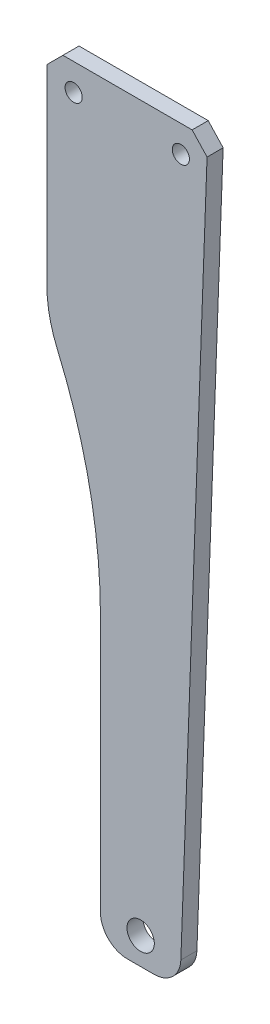
ISO-10303-21;
HEADER;
FILE_DESCRIPTION(('STEP AP214'),'2;1');
FILE_NAME('part.step','',(''),(''),'','','');
FILE_SCHEMA(('AUTOMOTIVE_DESIGN { 1 0 10303 214 1 1 1 1 }'));
ENDSEC;
DATA;
#1=APPLICATION_CONTEXT('core data for automotive mechanical design processes');
#2=APPLICATION_PROTOCOL_DEFINITION('international standard','automotive_design',2000,#1);
#3=PRODUCT_CONTEXT('',#1,'mechanical');
#4=PRODUCT('Part','Part','',(#3));
#5=PRODUCT_RELATED_PRODUCT_CATEGORY('part','',(#4));
#6=PRODUCT_DEFINITION_FORMATION('','',#4);
#7=PRODUCT_DEFINITION_CONTEXT('part definition',#1,'design');
#8=PRODUCT_DEFINITION('design','',#6,#7);
#9=PRODUCT_DEFINITION_SHAPE('','',#8);
#10=(LENGTH_UNIT() NAMED_UNIT(*) SI_UNIT(.MILLI.,.METRE.));
#11=(NAMED_UNIT(*) PLANE_ANGLE_UNIT() SI_UNIT($,.RADIAN.));
#12=(NAMED_UNIT(*) SI_UNIT($,.STERADIAN.) SOLID_ANGLE_UNIT());
#13=UNCERTAINTY_MEASURE_WITH_UNIT(LENGTH_MEASURE(1.E-05),#10,'distance_accuracy_value','');
#14=(GEOMETRIC_REPRESENTATION_CONTEXT(3) GLOBAL_UNCERTAINTY_ASSIGNED_CONTEXT((#13)) GLOBAL_UNIT_ASSIGNED_CONTEXT((#10,
#11,#12)) REPRESENTATION_CONTEXT('',''));
#15=CARTESIAN_POINT('',(0.,0.,0.));
#16=DIRECTION('',(0.,0.,1.));
#17=DIRECTION('',(1.,0.,0.));
#18=AXIS2_PLACEMENT_3D('',#15,#16,#17);
#19=CARTESIAN_POINT('',(0.,0.,3.));
#20=DIRECTION('',(0.,0.,1.));
#21=DIRECTION('',(1.,0.,0.));
#22=AXIS2_PLACEMENT_3D('',#19,#20,#21);
#23=PLANE('',#22);
#24=CARTESIAN_POINT('',(20.,0.,3.));
#25=DIRECTION('',(0.,0.,1.));
#26=DIRECTION('',(1.,0.,0.));
#27=AXIS2_PLACEMENT_3D('',#24,#25,#26);
#28=CIRCLE('',#27,1.6);
#29=CARTESIAN_POINT('',(21.6,0.,3.));
#30=VERTEX_POINT('',#29);
#31=EDGE_CURVE('E224',#30,#30,#28,.T.);
#32=ORIENTED_EDGE('',*,*,#31,.F.);
#33=EDGE_LOOP('',(#32));
#34=FACE_BOUND('',#33,.T.);
#35=CARTESIAN_POINT('',(0.,0.,3.));
#36=DIRECTION('',(0.,0.,1.));
#37=DIRECTION('',(1.,0.,0.));
#38=AXIS2_PLACEMENT_3D('',#35,#36,#37);
#39=CIRCLE('',#38,1.6);
#40=CARTESIAN_POINT('',(1.6,0.,3.));
#41=VERTEX_POINT('',#40);
#42=EDGE_CURVE('E230',#41,#41,#39,.T.);
#43=ORIENTED_EDGE('',*,*,#42,.F.);
#44=EDGE_LOOP('',(#43));
#45=FACE_BOUND('',#44,.T.);
#46=CARTESIAN_POINT('',(12.5,-130.,3.));
#47=DIRECTION('',(0.,0.,1.));
#48=DIRECTION('',(1.,0.,0.));
#49=AXIS2_PLACEMENT_3D('',#46,#47,#48);
#50=CIRCLE('',#49,2.54999999999999);
#51=CARTESIAN_POINT('',(15.05,-130.,3.));
#52=VERTEX_POINT('',#51);
#53=EDGE_CURVE('E207',#52,#52,#50,.T.);
#54=ORIENTED_EDGE('',*,*,#53,.F.);
#55=EDGE_LOOP('',(#54));
#56=FACE_BOUND('',#55,.T.);
#57=DIRECTION('',(-0.0369863533886422,-0.99931577074667,0.));
#58=VECTOR('',#57,1.);
#59=CARTESIAN_POINT('',(24.7809950103569,-0.917186204407043,3.));
#60=LINE('',#59,#58);
#61=CARTESIAN_POINT('',(24.8890409398341,2.00205268775997,3.));
#62=VERTEX_POINT('',#61);
#63=CARTESIAN_POINT('',(19.9965788537334,-130.184931766943,3.));
#64=VERTEX_POINT('',#63);
#65=EDGE_CURVE('E171',#62,#64,#60,.T.);
#66=ORIENTED_EDGE('',*,*,#65,.F.);
#67=DIRECTION('',(0.68046965674916,-0.732776259334103,0.));
#68=VECTOR('',#67,1.);
#69=CARTESIAN_POINT('',(14.3627330182041,13.3375008843198,3.));
#70=LINE('',#69,#68);
#71=CARTESIAN_POINT('',(22.1050913337621,5.,3.));
#72=VERTEX_POINT('',#71);
#73=EDGE_CURVE('E47',#62,#72,#70,.F.);
#74=ORIENTED_EDGE('',*,*,#73,.T.);
#75=DIRECTION('',(-1.,0.,0.));
#76=VECTOR('',#75,1.);
#77=CARTESIAN_POINT('',(-5.,5.,3.));
#78=LINE('',#77,#76);
#79=CARTESIAN_POINT('',(-1.99999999999997,5.,3.));
#80=VERTEX_POINT('',#79);
#81=EDGE_CURVE('E149',#72,#80,#78,.T.);
#82=ORIENTED_EDGE('',*,*,#81,.T.);
#83=DIRECTION('',(0.707106781186547,0.707106781186548,0.));
#84=VECTOR('',#83,1.);
#85=CARTESIAN_POINT('',(-3.49999999999999,3.49999999999999,3.));
#86=LINE('',#85,#84);
#87=CARTESIAN_POINT('',(-5.,1.99999999999997,3.));
#88=VERTEX_POINT('',#87);
#89=EDGE_CURVE('E54',#80,#88,#86,.F.);
#90=ORIENTED_EDGE('',*,*,#89,.T.);
#91=DIRECTION('',(0.,-1.,0.));
#92=VECTOR('',#91,1.);
#93=CARTESIAN_POINT('',(-5.,5.,3.));
#94=LINE('',#93,#92);
#95=CARTESIAN_POINT('',(-5.,-33.5602177653079,3.));
#96=VERTEX_POINT('',#95);
#97=EDGE_CURVE('E152',#88,#96,#94,.T.);
#98=ORIENTED_EDGE('',*,*,#97,.T.);
#99=CARTESIAN_POINT('',(18.8384945881613,-33.5602177653079,3.));
#100=DIRECTION('',(0.,0.,1.));
#101=DIRECTION('',(1.,0.,0.));
#102=AXIS2_PLACEMENT_3D('',#99,#100,#101);
#103=CIRCLE('',#102,23.8384945881613);
#104=CARTESIAN_POINT('',(-3.06746637805268,-42.9624886812358,3.));
#105=VERTEX_POINT('',#104);
#106=EDGE_CURVE('E197',#105,#96,#103,.F.);
#107=ORIENTED_EDGE('',*,*,#106,.F.);
#108=CARTESIAN_POINT('',(-94.5150880736522,-82.2127783683868,3.));
#109=DIRECTION('',(0.,0.,1.));
#110=DIRECTION('',(1.,0.,0.));
#111=AXIS2_PLACEMENT_3D('',#108,#109,#110);
#112=CIRCLE('',#111,99.5150880736522);
#113=CARTESIAN_POINT('',(5.,-82.2127783683868,3.));
#114=VERTEX_POINT('',#113);
#115=EDGE_CURVE('E200',#114,#105,#112,.T.);
#116=ORIENTED_EDGE('',*,*,#115,.F.);
#117=DIRECTION('',(0.,1.,0.));
#118=VECTOR('',#117,1.);
#119=CARTESIAN_POINT('',(5.,0.,3.));
#120=LINE('',#119,#118);
#121=CARTESIAN_POINT('',(5.,-130.,3.));
#122=VERTEX_POINT('',#121);
#123=EDGE_CURVE('E189',#122,#114,#120,.T.);
#124=ORIENTED_EDGE('',*,*,#123,.F.);
#125=CARTESIAN_POINT('',(10.,-130.,3.));
#126=DIRECTION('',(0.,0.,1.));
#127=DIRECTION('',(1.,0.,0.));
#128=AXIS2_PLACEMENT_3D('',#125,#126,#127);
#129=CIRCLE('',#128,5.);
#130=CARTESIAN_POINT('',(10.,-135.,3.));
#131=VERTEX_POINT('',#130);
#132=EDGE_CURVE('E192',#122,#131,#129,.T.);
#133=ORIENTED_EDGE('',*,*,#132,.T.);
#134=DIRECTION('',(1.,0.,0.));
#135=VECTOR('',#134,1.);
#136=CARTESIAN_POINT('',(-4.99999999999998,-135.,3.));
#137=LINE('',#136,#135);
#138=CARTESIAN_POINT('',(15.,-135.,3.));
#139=VERTEX_POINT('',#138);
#140=EDGE_CURVE('E161',#131,#139,#137,.T.);
#141=ORIENTED_EDGE('',*,*,#140,.T.);
#142=CARTESIAN_POINT('',(15.,-130.,3.));
#143=DIRECTION('',(0.,0.,1.));
#144=DIRECTION('',(1.,0.,0.));
#145=AXIS2_PLACEMENT_3D('',#142,#143,#144);
#146=CIRCLE('',#145,5.);
#147=EDGE_CURVE('E130',#139,#64,#146,.T.);
#148=ORIENTED_EDGE('',*,*,#147,.T.);
#149=EDGE_LOOP('',(#66,#74,#82,#90,#98,#107,#116,#124,#133,#141,#148));
#150=FACE_BOUND('',#149,.T.);
#151=ADVANCED_FACE('F39',(#34,#45,#56,#150),#23,.T.);
#152=CARTESIAN_POINT('',(0.,0.,0.));
#153=DIRECTION('',(0.,0.,1.));
#154=DIRECTION('',(1.,0.,0.));
#155=AXIS2_PLACEMENT_3D('',#152,#153,#154);
#156=PLANE('',#155);
#157=CARTESIAN_POINT('',(20.,0.,0.));
#158=DIRECTION('',(0.,0.,1.));
#159=DIRECTION('',(1.,0.,0.));
#160=AXIS2_PLACEMENT_3D('',#157,#158,#159);
#161=CIRCLE('',#160,1.6);
#162=CARTESIAN_POINT('',(21.6,0.,0.));
#163=VERTEX_POINT('',#162);
#164=EDGE_CURVE('E223',#163,#163,#161,.T.);
#165=ORIENTED_EDGE('',*,*,#164,.T.);
#166=EDGE_LOOP('',(#165));
#167=FACE_BOUND('',#166,.T.);
#168=CARTESIAN_POINT('',(0.,0.,0.));
#169=DIRECTION('',(0.,0.,1.));
#170=DIRECTION('',(1.,0.,0.));
#171=AXIS2_PLACEMENT_3D('',#168,#169,#170);
#172=CIRCLE('',#171,1.6);
#173=CARTESIAN_POINT('',(1.6,0.,0.));
#174=VERTEX_POINT('',#173);
#175=EDGE_CURVE('E227',#174,#174,#172,.T.);
#176=ORIENTED_EDGE('',*,*,#175,.T.);
#177=EDGE_LOOP('',(#176));
#178=FACE_BOUND('',#177,.T.);
#179=CARTESIAN_POINT('',(12.5,-130.,0.));
#180=DIRECTION('',(0.,0.,1.));
#181=DIRECTION('',(1.,0.,0.));
#182=AXIS2_PLACEMENT_3D('',#179,#180,#181);
#183=CIRCLE('',#182,2.54999999999999);
#184=CARTESIAN_POINT('',(15.05,-130.,0.));
#185=VERTEX_POINT('',#184);
#186=EDGE_CURVE('E220',#185,#185,#183,.F.);
#187=ORIENTED_EDGE('',*,*,#186,.F.);
#188=EDGE_LOOP('',(#187));
#189=FACE_BOUND('',#188,.T.);
#190=DIRECTION('',(-1.,0.,0.));
#191=VECTOR('',#190,1.);
#192=CARTESIAN_POINT('',(-5.,5.,0.));
#193=LINE('',#192,#191);
#194=CARTESIAN_POINT('',(22.1050913337621,5.,0.));
#195=VERTEX_POINT('',#194);
#196=CARTESIAN_POINT('',(-1.99999999999997,5.,0.));
#197=VERTEX_POINT('',#196);
#198=EDGE_CURVE('E154',#195,#197,#193,.T.);
#199=ORIENTED_EDGE('',*,*,#198,.F.);
#200=DIRECTION('',(-0.68046965674916,0.732776259334103,0.));
#201=VECTOR('',#200,1.);
#202=CARTESIAN_POINT('',(22.1050913337621,5.,0.));
#203=LINE('',#202,#201);
#204=CARTESIAN_POINT('',(24.8890409398341,2.00205268775997,0.));
#205=VERTEX_POINT('',#204);
#206=EDGE_CURVE('E166',#195,#205,#203,.F.);
#207=ORIENTED_EDGE('',*,*,#206,.T.);
#208=DIRECTION('',(-0.0369863533886422,-0.99931577074667,0.));
#209=VECTOR('',#208,1.);
#210=CARTESIAN_POINT('',(24.7809950103569,-0.917186204407043,0.));
#211=LINE('',#210,#209);
#212=CARTESIAN_POINT('',(19.9965788537334,-130.184931766943,0.));
#213=VERTEX_POINT('',#212);
#214=EDGE_CURVE('E143',#205,#213,#211,.T.);
#215=ORIENTED_EDGE('',*,*,#214,.T.);
#216=CARTESIAN_POINT('',(15.,-130.,0.));
#217=DIRECTION('',(0.,0.,1.));
#218=DIRECTION('',(1.,0.,0.));
#219=AXIS2_PLACEMENT_3D('',#216,#217,#218);
#220=CIRCLE('',#219,5.);
#221=CARTESIAN_POINT('',(15.,-135.,0.));
#222=VERTEX_POINT('',#221);
#223=EDGE_CURVE('E128',#222,#213,#220,.T.);
#224=ORIENTED_EDGE('',*,*,#223,.F.);
#225=DIRECTION('',(1.,0.,0.));
#226=VECTOR('',#225,1.);
#227=CARTESIAN_POINT('',(-4.99999999999998,-135.,0.));
#228=LINE('',#227,#226);
#229=CARTESIAN_POINT('',(10.,-135.,0.));
#230=VERTEX_POINT('',#229);
#231=EDGE_CURVE('E141',#230,#222,#228,.T.);
#232=ORIENTED_EDGE('',*,*,#231,.F.);
#233=CARTESIAN_POINT('',(10.,-130.,0.));
#234=DIRECTION('',(0.,0.,1.));
#235=DIRECTION('',(1.,0.,0.));
#236=AXIS2_PLACEMENT_3D('',#233,#234,#235);
#237=CIRCLE('',#236,5.);
#238=CARTESIAN_POINT('',(5.,-130.,0.));
#239=VERTEX_POINT('',#238);
#240=EDGE_CURVE('E145',#239,#230,#237,.T.);
#241=ORIENTED_EDGE('',*,*,#240,.F.);
#242=DIRECTION('',(0.,1.,0.));
#243=VECTOR('',#242,1.);
#244=CARTESIAN_POINT('',(5.,0.,0.));
#245=LINE('',#244,#243);
#246=CARTESIAN_POINT('',(5.,-82.2127783683868,0.));
#247=VERTEX_POINT('',#246);
#248=EDGE_CURVE('E203',#239,#247,#245,.T.);
#249=ORIENTED_EDGE('',*,*,#248,.T.);
#250=CARTESIAN_POINT('',(-94.5150880736522,-82.2127783683868,0.));
#251=DIRECTION('',(0.,0.,1.));
#252=DIRECTION('',(1.,0.,0.));
#253=AXIS2_PLACEMENT_3D('',#250,#251,#252);
#254=CIRCLE('',#253,99.5150880736522);
#255=CARTESIAN_POINT('',(-3.06746637805268,-42.9624886812358,0.));
#256=VERTEX_POINT('',#255);
#257=EDGE_CURVE('E183',#247,#256,#254,.T.);
#258=ORIENTED_EDGE('',*,*,#257,.T.);
#259=CARTESIAN_POINT('',(18.8384945881613,-33.5602177653079,0.));
#260=DIRECTION('',(0.,0.,1.));
#261=DIRECTION('',(1.,0.,0.));
#262=AXIS2_PLACEMENT_3D('',#259,#260,#261);
#263=CIRCLE('',#262,23.8384945881613);
#264=CARTESIAN_POINT('',(-5.,-33.5602177653079,0.));
#265=VERTEX_POINT('',#264);
#266=EDGE_CURVE('E180',#256,#265,#263,.F.);
#267=ORIENTED_EDGE('',*,*,#266,.T.);
#268=DIRECTION('',(0.,-1.,0.));
#269=VECTOR('',#268,1.);
#270=CARTESIAN_POINT('',(-5.,5.,0.));
#271=LINE('',#270,#269);
#272=CARTESIAN_POINT('',(-5.,1.99999999999997,0.));
#273=VERTEX_POINT('',#272);
#274=EDGE_CURVE('E150',#273,#265,#271,.T.);
#275=ORIENTED_EDGE('',*,*,#274,.F.);
#276=DIRECTION('',(-0.707106781186547,-0.707106781186548,0.));
#277=VECTOR('',#276,1.);
#278=CARTESIAN_POINT('',(-5.,1.99999999999997,0.));
#279=LINE('',#278,#277);
#280=EDGE_CURVE('E164',#273,#197,#279,.F.);
#281=ORIENTED_EDGE('',*,*,#280,.T.);
#282=EDGE_LOOP('',(#199,#207,#215,#224,#232,#241,#249,#258,#267,#275,#281));
#283=FACE_BOUND('',#282,.T.);
#284=ADVANCED_FACE('F140',(#167,#178,#189,#283),#156,.F.);
#285=CARTESIAN_POINT('',(-4.99999999999998,-135.,3.));
#286=DIRECTION('',(0.,1.,0.));
#287=DIRECTION('',(0.,0.,1.));
#288=AXIS2_PLACEMENT_3D('',#285,#286,#287);
#289=PLANE('',#288);
#290=ORIENTED_EDGE('',*,*,#231,.T.);
#291=DIRECTION('',(0.,0.,1.));
#292=VECTOR('',#291,1.);
#293=CARTESIAN_POINT('',(15.,-135.,0.));
#294=LINE('',#293,#292);
#295=EDGE_CURVE('E124',#222,#139,#294,.T.);
#296=ORIENTED_EDGE('',*,*,#295,.T.);
#297=ORIENTED_EDGE('',*,*,#140,.F.);
#298=DIRECTION('',(0.,0.,1.));
#299=VECTOR('',#298,1.);
#300=CARTESIAN_POINT('',(10.,-135.,0.));
#301=LINE('',#300,#299);
#302=EDGE_CURVE('E135',#230,#131,#301,.T.);
#303=ORIENTED_EDGE('',*,*,#302,.F.);
#304=EDGE_LOOP('',(#290,#296,#297,#303));
#305=FACE_BOUND('',#304,.T.);
#306=ADVANCED_FACE('F147',(#305),#289,.F.);
#307=CARTESIAN_POINT('',(-5.,5.,3.));
#308=DIRECTION('',(0.,-1.,0.));
#309=DIRECTION('',(0.,0.,-1.));
#310=AXIS2_PLACEMENT_3D('',#307,#308,#309);
#311=PLANE('',#310);
#312=ORIENTED_EDGE('',*,*,#81,.F.);
#313=DIRECTION('',(0.,0.,-1.));
#314=VECTOR('',#313,1.);
#315=CARTESIAN_POINT('',(22.1050913337621,5.,3.));
#316=LINE('',#315,#314);
#317=EDGE_CURVE('E160',#72,#195,#316,.T.);
#318=ORIENTED_EDGE('',*,*,#317,.T.);
#319=ORIENTED_EDGE('',*,*,#198,.T.);
#320=DIRECTION('',(0.,0.,1.));
#321=VECTOR('',#320,1.);
#322=CARTESIAN_POINT('',(-1.99999999999997,5.,3.));
#323=LINE('',#322,#321);
#324=EDGE_CURVE('E158',#197,#80,#323,.T.);
#325=ORIENTED_EDGE('',*,*,#324,.T.);
#326=EDGE_LOOP('',(#312,#318,#319,#325));
#327=FACE_BOUND('',#326,.T.);
#328=ADVANCED_FACE('F175',(#327),#311,.F.);
#329=CARTESIAN_POINT('',(-5.,5.,3.));
#330=DIRECTION('',(1.,0.,0.));
#331=DIRECTION('',(0.,1.,0.));
#332=AXIS2_PLACEMENT_3D('',#329,#330,#331);
#333=PLANE('',#332);
#334=ORIENTED_EDGE('',*,*,#97,.F.);
#335=DIRECTION('',(0.,0.,-1.));
#336=VECTOR('',#335,1.);
#337=CARTESIAN_POINT('',(-5.,1.99999999999997,3.));
#338=LINE('',#337,#336);
#339=EDGE_CURVE('E11',#88,#273,#338,.T.);
#340=ORIENTED_EDGE('',*,*,#339,.T.);
#341=ORIENTED_EDGE('',*,*,#274,.T.);
#342=DIRECTION('',(0.,0.,1.));
#343=VECTOR('',#342,1.);
#344=CARTESIAN_POINT('',(-5.,-33.5602177653079,0.));
#345=LINE('',#344,#343);
#346=EDGE_CURVE('E211',#265,#96,#345,.T.);
#347=ORIENTED_EDGE('',*,*,#346,.T.);
#348=EDGE_LOOP('',(#334,#340,#341,#347));
#349=FACE_BOUND('',#348,.T.);
#350=ADVANCED_FACE('F240',(#349),#333,.F.);
#351=CARTESIAN_POINT('',(0.,0.,3.));
#352=DIRECTION('',(0.,0.,-1.));
#353=DIRECTION('',(-1.,0.,0.));
#354=AXIS2_PLACEMENT_3D('',#351,#352,#353);
#355=CYLINDRICAL_SURFACE('',#354,1.6);
#356=ORIENTED_EDGE('',*,*,#42,.T.);
#357=EDGE_LOOP('',(#356));
#358=FACE_BOUND('',#357,.T.);
#359=ORIENTED_EDGE('',*,*,#175,.F.);
#360=EDGE_LOOP('',(#359));
#361=FACE_BOUND('',#360,.T.);
#362=ADVANCED_FACE('F282',(#358,#361),#355,.F.);
#363=CARTESIAN_POINT('',(20.,0.,3.));
#364=DIRECTION('',(0.,0.,-1.));
#365=DIRECTION('',(-1.,0.,0.));
#366=AXIS2_PLACEMENT_3D('',#363,#364,#365);
#367=CYLINDRICAL_SURFACE('',#366,1.6);
#368=ORIENTED_EDGE('',*,*,#31,.T.);
#369=EDGE_LOOP('',(#368));
#370=FACE_BOUND('',#369,.T.);
#371=ORIENTED_EDGE('',*,*,#164,.F.);
#372=EDGE_LOOP('',(#371));
#373=FACE_BOUND('',#372,.T.);
#374=ADVANCED_FACE('F266',(#370,#373),#367,.F.);
#375=CARTESIAN_POINT('',(12.5,-130.,-0.00100000000000013));
#376=DIRECTION('',(0.,0.,1.));
#377=DIRECTION('',(1.,0.,0.));
#378=AXIS2_PLACEMENT_3D('',#375,#376,#377);
#379=CYLINDRICAL_SURFACE('',#378,2.54999999999999);
#380=CARTESIAN_POINT('',(15.05,-130.,3.));
#381=CARTESIAN_POINT('',(15.05,-130.,2.96875));
#382=CARTESIAN_POINT('',(15.05,-130.,2.9375));
#383=CARTESIAN_POINT('',(15.05,-130.,2.875));
#384=CARTESIAN_POINT('',(15.05,-130.,2.84375));
#385=CARTESIAN_POINT('',(15.05,-130.,2.78125));
#386=CARTESIAN_POINT('',(15.05,-130.,2.75));
#387=CARTESIAN_POINT('',(15.05,-130.,2.6875));
#388=CARTESIAN_POINT('',(15.05,-130.,2.65625));
#389=CARTESIAN_POINT('',(15.05,-130.,2.59375));
#390=CARTESIAN_POINT('',(15.05,-130.,2.5625));
#391=CARTESIAN_POINT('',(15.05,-130.,2.5));
#392=CARTESIAN_POINT('',(15.05,-130.,2.46875));
#393=CARTESIAN_POINT('',(15.05,-130.,2.40625));
#394=CARTESIAN_POINT('',(15.05,-130.,2.375));
#395=CARTESIAN_POINT('',(15.05,-130.,2.3125));
#396=CARTESIAN_POINT('',(15.05,-130.,2.28125));
#397=CARTESIAN_POINT('',(15.05,-130.,2.21875));
#398=CARTESIAN_POINT('',(15.05,-130.,2.1875));
#399=CARTESIAN_POINT('',(15.05,-130.,2.125));
#400=CARTESIAN_POINT('',(15.05,-130.,2.09375));
#401=CARTESIAN_POINT('',(15.05,-130.,2.03125));
#402=CARTESIAN_POINT('',(15.05,-130.,2.));
#403=CARTESIAN_POINT('',(15.05,-130.,1.9375));
#404=CARTESIAN_POINT('',(15.05,-130.,1.90625));
#405=CARTESIAN_POINT('',(15.05,-130.,1.84375));
#406=CARTESIAN_POINT('',(15.05,-130.,1.8125));
#407=CARTESIAN_POINT('',(15.05,-130.,1.75));
#408=CARTESIAN_POINT('',(15.05,-130.,1.71875));
#409=CARTESIAN_POINT('',(15.05,-130.,1.65625));
#410=CARTESIAN_POINT('',(15.05,-130.,1.625));
#411=CARTESIAN_POINT('',(15.05,-130.,1.5625));
#412=CARTESIAN_POINT('',(15.05,-130.,1.53125));
#413=CARTESIAN_POINT('',(15.05,-130.,1.46875));
#414=CARTESIAN_POINT('',(15.05,-130.,1.4375));
#415=CARTESIAN_POINT('',(15.05,-130.,1.375));
#416=CARTESIAN_POINT('',(15.05,-130.,1.34375));
#417=CARTESIAN_POINT('',(15.05,-130.,1.28125));
#418=CARTESIAN_POINT('',(15.05,-130.,1.25));
#419=CARTESIAN_POINT('',(15.05,-130.,1.1875));
#420=CARTESIAN_POINT('',(15.05,-130.,1.15625));
#421=CARTESIAN_POINT('',(15.05,-130.,1.09375));
#422=CARTESIAN_POINT('',(15.05,-130.,1.0625));
#423=CARTESIAN_POINT('',(15.05,-130.,1.));
#424=CARTESIAN_POINT('',(15.05,-130.,0.96875));
#425=CARTESIAN_POINT('',(15.05,-130.,0.90625));
#426=CARTESIAN_POINT('',(15.05,-130.,0.875));
#427=CARTESIAN_POINT('',(15.05,-130.,0.8125));
#428=CARTESIAN_POINT('',(15.05,-130.,0.78125));
#429=CARTESIAN_POINT('',(15.05,-130.,0.71875));
#430=CARTESIAN_POINT('',(15.05,-130.,0.6875));
#431=CARTESIAN_POINT('',(15.05,-130.,0.625));
#432=CARTESIAN_POINT('',(15.05,-130.,0.59375));
#433=CARTESIAN_POINT('',(15.05,-130.,0.53125));
#434=CARTESIAN_POINT('',(15.05,-130.,0.5));
#435=CARTESIAN_POINT('',(15.05,-130.,0.4375));
#436=CARTESIAN_POINT('',(15.05,-130.,0.40625));
#437=CARTESIAN_POINT('',(15.05,-130.,0.34375));
#438=CARTESIAN_POINT('',(15.05,-130.,0.3125));
#439=CARTESIAN_POINT('',(15.05,-130.,0.25));
#440=CARTESIAN_POINT('',(15.05,-130.,0.21875));
#441=CARTESIAN_POINT('',(15.05,-130.,0.15625));
#442=CARTESIAN_POINT('',(15.05,-130.,0.125));
#443=CARTESIAN_POINT('',(15.05,-130.,0.0625000000000001));
#444=CARTESIAN_POINT('',(15.05,-130.,0.0312500000000001));
#445=CARTESIAN_POINT('',(15.05,-130.,0.));
#446=B_SPLINE_CURVE_WITH_KNOTS('',3,(#380,#381,#382,#383,#384,#385,#386,#387,#388,#389,#390,
#391,#392,#393,#394,#395,#396,#397,#398,#399,#400,#401,#402,#403,#404,#405,#406,#407,#408,#409,
#410,#411,#412,#413,#414,#415,#416,#417,#418,#419,#420,#421,#422,#423,#424,#425,#426,#427,#428,
#429,#430,#431,#432,#433,#434,#435,#436,#437,#438,#439,#440,#441,#442,#443,#444,#445),
.UNSPECIFIED.,.F.,.F.,(4,2,2,2,2,2,2,2,2,2,2,2,2,2,2,2,2,2,2,2,2,2,2,2,2,2,2,2,2,2,2,2,4),(0.,
0.0937500000000001,0.1875,0.28125,0.375,0.46875,0.5625,0.65625,0.75,0.84375,0.9375,1.03125,
1.125,1.21875,1.3125,1.40625,1.5,1.59375,1.6875,1.78125,1.875,1.96875,2.0625,2.15625,2.25,
2.34375,2.4375,2.53125,2.625,2.71875,2.8125,2.90625,3.),.UNSPECIFIED.);
#447=EDGE_CURVE('BSEAM259',#52,#185,#446,.T.);
#448=ORIENTED_EDGE('',*,*,#53,.T.);
#449=ORIENTED_EDGE('',*,*,#186,.T.);
#450=ORIENTED_EDGE('',*,*,#447,.T.);
#451=ORIENTED_EDGE('',*,*,#447,.F.);
#452=EDGE_LOOP('',(#448,#450,#449,#451));
#453=FACE_BOUND('',#452,.T.);
#454=ADVANCED_FACE('F259',(#453),#379,.F.);
#455=CARTESIAN_POINT('',(10.,-130.,0.));
#456=DIRECTION('',(0.,0.,1.));
#457=DIRECTION('',(1.,0.,0.));
#458=AXIS2_PLACEMENT_3D('',#455,#456,#457);
#459=CYLINDRICAL_SURFACE('',#458,5.);
#460=ORIENTED_EDGE('',*,*,#132,.F.);
#461=DIRECTION('',(0.,0.,1.));
#462=VECTOR('',#461,1.);
#463=CARTESIAN_POINT('',(5.,-130.,0.));
#464=LINE('',#463,#462);
#465=EDGE_CURVE('E188',#239,#122,#464,.T.);
#466=ORIENTED_EDGE('',*,*,#465,.F.);
#467=ORIENTED_EDGE('',*,*,#240,.T.);
#468=ORIENTED_EDGE('',*,*,#302,.T.);
#469=EDGE_LOOP('',(#460,#466,#467,#468));
#470=FACE_BOUND('',#469,.T.);
#471=ADVANCED_FACE('F256',(#470),#459,.T.);
#472=CARTESIAN_POINT('',(18.8384945881613,-33.5602177653079,0.));
#473=DIRECTION('',(0.,0.,1.));
#474=DIRECTION('',(1.,0.,0.));
#475=AXIS2_PLACEMENT_3D('',#472,#473,#474);
#476=CYLINDRICAL_SURFACE('',#475,23.8384945881613);
#477=ORIENTED_EDGE('',*,*,#106,.T.);
#478=ORIENTED_EDGE('',*,*,#346,.F.);
#479=ORIENTED_EDGE('',*,*,#266,.F.);
#480=DIRECTION('',(0.,0.,1.));
#481=VECTOR('',#480,1.);
#482=CARTESIAN_POINT('',(-3.06746637805268,-42.9624886812358,0.));
#483=LINE('',#482,#481);
#484=EDGE_CURVE('E208',#256,#105,#483,.T.);
#485=ORIENTED_EDGE('',*,*,#484,.T.);
#486=EDGE_LOOP('',(#477,#478,#479,#485));
#487=FACE_BOUND('',#486,.T.);
#488=ADVANCED_FACE('F246',(#487),#476,.T.);
#489=CARTESIAN_POINT('',(-94.5150880736522,-82.2127783683868,0.));
#490=DIRECTION('',(0.,0.,1.));
#491=DIRECTION('',(1.,0.,0.));
#492=AXIS2_PLACEMENT_3D('',#489,#490,#491);
#493=CYLINDRICAL_SURFACE('',#492,99.5150880736522);
#494=ORIENTED_EDGE('',*,*,#115,.T.);
#495=ORIENTED_EDGE('',*,*,#484,.F.);
#496=ORIENTED_EDGE('',*,*,#257,.F.);
#497=DIRECTION('',(0.,0.,1.));
#498=VECTOR('',#497,1.);
#499=CARTESIAN_POINT('',(5.,-82.2127783683868,0.));
#500=LINE('',#499,#498);
#501=EDGE_CURVE('E204',#247,#114,#500,.T.);
#502=ORIENTED_EDGE('',*,*,#501,.T.);
#503=EDGE_LOOP('',(#494,#495,#496,#502));
#504=FACE_BOUND('',#503,.T.);
#505=ADVANCED_FACE('F248',(#504),#493,.F.);
#506=CARTESIAN_POINT('',(5.,0.,0.));
#507=DIRECTION('',(1.,0.,0.));
#508=DIRECTION('',(0.,0.,-1.));
#509=AXIS2_PLACEMENT_3D('',#506,#507,#508);
#510=PLANE('',#509);
#511=ORIENTED_EDGE('',*,*,#123,.T.);
#512=ORIENTED_EDGE('',*,*,#501,.F.);
#513=ORIENTED_EDGE('',*,*,#248,.F.);
#514=ORIENTED_EDGE('',*,*,#465,.T.);
#515=EDGE_LOOP('',(#511,#512,#513,#514));
#516=FACE_BOUND('',#515,.T.);
#517=ADVANCED_FACE('F252',(#516),#510,.F.);
#518=CARTESIAN_POINT('',(24.7809950103569,-0.917186204407043,0.));
#519=DIRECTION('',(-0.99931577074667,0.0369863533886422,0.));
#520=DIRECTION('',(-0.0369863533886422,-0.99931577074667,0.));
#521=AXIS2_PLACEMENT_3D('',#518,#519,#520);
#522=PLANE('',#521);
#523=ORIENTED_EDGE('',*,*,#214,.F.);
#524=DIRECTION('',(0.,0.,1.));
#525=VECTOR('',#524,1.);
#526=CARTESIAN_POINT('',(24.8890409398341,2.00205268775997,0.));
#527=LINE('',#526,#525);
#528=EDGE_CURVE('E62',#205,#62,#527,.T.);
#529=ORIENTED_EDGE('',*,*,#528,.T.);
#530=ORIENTED_EDGE('',*,*,#65,.T.);
#531=DIRECTION('',(0.,0.,1.));
#532=VECTOR('',#531,1.);
#533=CARTESIAN_POINT('',(19.9965788537334,-130.184931766943,0.));
#534=LINE('',#533,#532);
#535=EDGE_CURVE('E134',#213,#64,#534,.T.);
#536=ORIENTED_EDGE('',*,*,#535,.F.);
#537=EDGE_LOOP('',(#523,#529,#530,#536));
#538=FACE_BOUND('',#537,.T.);
#539=ADVANCED_FACE('F179',(#538),#522,.F.);
#540=CARTESIAN_POINT('',(15.,-130.,0.));
#541=DIRECTION('',(0.,0.,1.));
#542=DIRECTION('',(1.,0.,0.));
#543=AXIS2_PLACEMENT_3D('',#540,#541,#542);
#544=CYLINDRICAL_SURFACE('',#543,5.);
#545=ORIENTED_EDGE('',*,*,#147,.F.);
#546=ORIENTED_EDGE('',*,*,#295,.F.);
#547=ORIENTED_EDGE('',*,*,#223,.T.);
#548=ORIENTED_EDGE('',*,*,#535,.T.);
#549=EDGE_LOOP('',(#545,#546,#547,#548));
#550=FACE_BOUND('',#549,.T.);
#551=ADVANCED_FACE('F126',(#550),#544,.T.);
#552=CARTESIAN_POINT('',(22.1050913337621,5.,3.));
#553=DIRECTION('',(-0.732776259334103,-0.68046965674916,0.));
#554=DIRECTION('',(0.,0.,-1.));
#555=AXIS2_PLACEMENT_3D('',#552,#553,#554);
#556=PLANE('',#555);
#557=ORIENTED_EDGE('',*,*,#73,.F.);
#558=ORIENTED_EDGE('',*,*,#528,.F.);
#559=ORIENTED_EDGE('',*,*,#206,.F.);
#560=ORIENTED_EDGE('',*,*,#317,.F.);
#561=EDGE_LOOP('',(#557,#558,#559,#560));
#562=FACE_BOUND('',#561,.T.);
#563=ADVANCED_FACE('F178',(#562),#556,.F.);
#564=CARTESIAN_POINT('',(-5.,1.99999999999997,3.));
#565=DIRECTION('',(0.707106781186547,-0.707106781186547,0.));
#566=DIRECTION('',(0.,0.,-1.));
#567=AXIS2_PLACEMENT_3D('',#564,#565,#566);
#568=PLANE('',#567);
#569=ORIENTED_EDGE('',*,*,#89,.F.);
#570=ORIENTED_EDGE('',*,*,#324,.F.);
#571=ORIENTED_EDGE('',*,*,#280,.F.);
#572=ORIENTED_EDGE('',*,*,#339,.F.);
#573=EDGE_LOOP('',(#569,#570,#571,#572));
#574=FACE_BOUND('',#573,.T.);
#575=ADVANCED_FACE('F41',(#574),#568,.F.);
#576=CLOSED_SHELL('',(#151,#284,#306,#328,#350,#362,#374,#454,#471,#488,#505,#517,#539,#551,
#563,#575));
#577=MANIFOLD_SOLID_BREP('B2',#576);
#578=ADVANCED_BREP_SHAPE_REPRESENTATION('',(#18,#577),#14);
#579=SHAPE_DEFINITION_REPRESENTATION(#9,#578);
ENDSEC;
END-ISO-10303-21;
